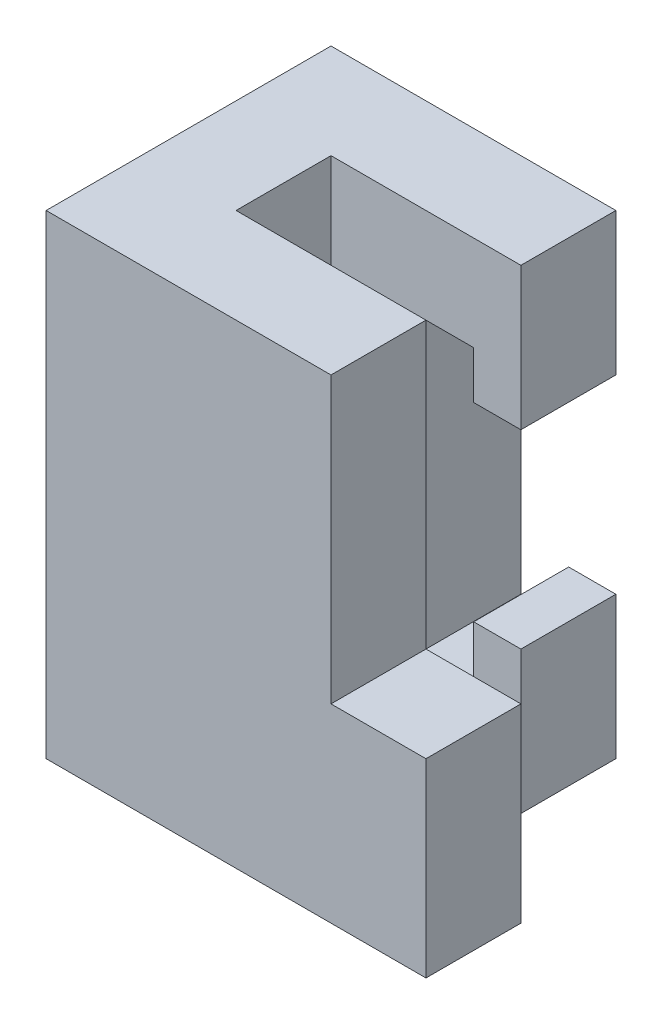
ISO-10303-21;
HEADER;
FILE_DESCRIPTION(('STEP AP214'),'2;1');
FILE_NAME('part.step','',(''),(''),'','','');
FILE_SCHEMA(('AUTOMOTIVE_DESIGN { 1 0 10303 214 1 1 1 1 }'));
ENDSEC;
DATA;
#1=APPLICATION_CONTEXT('core data for automotive mechanical design processes');
#2=APPLICATION_PROTOCOL_DEFINITION('international standard','automotive_design',2000,#1);
#3=PRODUCT_CONTEXT('',#1,'mechanical');
#4=PRODUCT('Part','Part','',(#3));
#5=PRODUCT_RELATED_PRODUCT_CATEGORY('part','',(#4));
#6=PRODUCT_DEFINITION_FORMATION('','',#4);
#7=PRODUCT_DEFINITION_CONTEXT('part definition',#1,'design');
#8=PRODUCT_DEFINITION('design','',#6,#7);
#9=PRODUCT_DEFINITION_SHAPE('','',#8);
#10=(LENGTH_UNIT() NAMED_UNIT(*) SI_UNIT(.MILLI.,.METRE.));
#11=(NAMED_UNIT(*) PLANE_ANGLE_UNIT() SI_UNIT($,.RADIAN.));
#12=(NAMED_UNIT(*) SI_UNIT($,.STERADIAN.) SOLID_ANGLE_UNIT());
#13=UNCERTAINTY_MEASURE_WITH_UNIT(LENGTH_MEASURE(1.E-05),#10,'distance_accuracy_value','');
#14=(GEOMETRIC_REPRESENTATION_CONTEXT(3) GLOBAL_UNCERTAINTY_ASSIGNED_CONTEXT((#13)) GLOBAL_UNIT_ASSIGNED_CONTEXT((#10,
#11,#12)) REPRESENTATION_CONTEXT('',''));
#15=CARTESIAN_POINT('',(0.,0.,0.));
#16=DIRECTION('',(0.,0.,1.));
#17=DIRECTION('',(1.,0.,0.));
#18=AXIS2_PLACEMENT_3D('',#15,#16,#17);
#19=CARTESIAN_POINT('',(25.4,63.5,0.));
#20=DIRECTION('',(-1.,0.,0.));
#21=DIRECTION('',(0.,0.,1.));
#22=AXIS2_PLACEMENT_3D('',#19,#20,#21);
#23=PLANE('',#22);
#24=DIRECTION('',(0.,0.,1.));
#25=VECTOR('',#24,1.);
#26=CARTESIAN_POINT('',(25.4,25.4,0.));
#27=LINE('',#26,#25);
#28=CARTESIAN_POINT('',(25.4,25.4,0.));
#29=VERTEX_POINT('',#28);
#30=CARTESIAN_POINT('',(25.4,25.4,12.7));
#31=VERTEX_POINT('',#30);
#32=EDGE_CURVE('E59',#29,#31,#27,.T.);
#33=ORIENTED_EDGE('',*,*,#32,.F.);
#34=DIRECTION('',(0.,-1.,0.));
#35=VECTOR('',#34,1.);
#36=CARTESIAN_POINT('',(25.4,63.5,0.));
#37=LINE('',#36,#35);
#38=CARTESIAN_POINT('',(25.4,63.5,0.));
#39=VERTEX_POINT('',#38);
#40=EDGE_CURVE('E334',#39,#29,#37,.T.);
#41=ORIENTED_EDGE('',*,*,#40,.F.);
#42=DIRECTION('',(0.,0.,-1.));
#43=VECTOR('',#42,1.);
#44=CARTESIAN_POINT('',(25.4,63.5,0.));
#45=LINE('',#44,#43);
#46=CARTESIAN_POINT('',(25.4,63.5,12.7));
#47=VERTEX_POINT('',#46);
#48=EDGE_CURVE('E307',#47,#39,#45,.T.);
#49=ORIENTED_EDGE('',*,*,#48,.F.);
#50=DIRECTION('',(0.,-1.,0.));
#51=VECTOR('',#50,1.);
#52=CARTESIAN_POINT('',(25.4,63.5,12.7));
#53=LINE('',#52,#51);
#54=EDGE_CURVE('E55',#47,#31,#53,.T.);
#55=ORIENTED_EDGE('',*,*,#54,.T.);
#56=EDGE_LOOP('',(#33,#41,#49,#55));
#57=FACE_BOUND('',#56,.T.);
#58=ADVANCED_FACE('F39',(#57),#23,.F.);
#59=CARTESIAN_POINT('',(25.4,63.5,-25.4));
#60=DIRECTION('',(-1.,0.,0.));
#61=DIRECTION('',(0.,0.,1.));
#62=AXIS2_PLACEMENT_3D('',#59,#60,#61);
#63=PLANE('',#62);
#64=DIRECTION('',(0.,-1.,0.));
#65=VECTOR('',#64,1.);
#66=CARTESIAN_POINT('',(25.4,63.5,-12.7));
#67=LINE('',#66,#65);
#68=CARTESIAN_POINT('',(25.4,63.5,-12.7));
#69=VERTEX_POINT('',#68);
#70=CARTESIAN_POINT('',(25.4,44.45,-12.7));
#71=VERTEX_POINT('',#70);
#72=EDGE_CURVE('E48',#69,#71,#67,.T.);
#73=ORIENTED_EDGE('',*,*,#72,.T.);
#74=DIRECTION('',(0.,0.,-1.));
#75=VECTOR('',#74,1.);
#76=CARTESIAN_POINT('',(25.4,44.45,-12.7));
#77=LINE('',#76,#75);
#78=CARTESIAN_POINT('',(25.4,44.45,-25.4));
#79=VERTEX_POINT('',#78);
#80=EDGE_CURVE('E265',#71,#79,#77,.T.);
#81=ORIENTED_EDGE('',*,*,#80,.T.);
#82=DIRECTION('',(0.,-1.,0.));
#83=VECTOR('',#82,1.);
#84=CARTESIAN_POINT('',(25.4,63.5,-25.4));
#85=LINE('',#84,#83);
#86=CARTESIAN_POINT('',(25.4,63.5,-25.4));
#87=VERTEX_POINT('',#86);
#88=EDGE_CURVE('E348',#87,#79,#85,.T.);
#89=ORIENTED_EDGE('',*,*,#88,.F.);
#90=DIRECTION('',(0.,0.,-1.));
#91=VECTOR('',#90,1.);
#92=CARTESIAN_POINT('',(25.4,63.5,-25.4));
#93=LINE('',#92,#91);
#94=EDGE_CURVE('E295',#69,#87,#93,.T.);
#95=ORIENTED_EDGE('',*,*,#94,.F.);
#96=EDGE_LOOP('',(#73,#81,#89,#95));
#97=FACE_BOUND('',#96,.T.);
#98=ADVANCED_FACE('F384',(#97),#63,.F.);
#99=CARTESIAN_POINT('',(0.,63.5,-12.7));
#100=DIRECTION('',(-1.,0.,0.));
#101=DIRECTION('',(0.,0.,1.));
#102=AXIS2_PLACEMENT_3D('',#99,#100,#101);
#103=PLANE('',#102);
#104=DIRECTION('',(0.,0.,-1.));
#105=VECTOR('',#104,1.);
#106=CARTESIAN_POINT('',(0.,0.,-12.7));
#107=LINE('',#106,#105);
#108=CARTESIAN_POINT('',(0.,0.,0.));
#109=VERTEX_POINT('',#108);
#110=CARTESIAN_POINT('',(0.,0.,-12.7));
#111=VERTEX_POINT('',#110);
#112=EDGE_CURVE('E172',#109,#111,#107,.T.);
#113=ORIENTED_EDGE('',*,*,#112,.T.);
#114=DIRECTION('',(0.,-1.,0.));
#115=VECTOR('',#114,1.);
#116=CARTESIAN_POINT('',(0.,63.5,-12.7));
#117=LINE('',#116,#115);
#118=CARTESIAN_POINT('',(0.,63.5,-12.7));
#119=VERTEX_POINT('',#118);
#120=EDGE_CURVE('E11',#119,#111,#117,.T.);
#121=ORIENTED_EDGE('',*,*,#120,.F.);
#122=DIRECTION('',(0.,0.,-1.));
#123=VECTOR('',#122,1.);
#124=CARTESIAN_POINT('',(0.,63.5,-12.7));
#125=LINE('',#124,#123);
#126=CARTESIAN_POINT('',(0.,63.5,0.));
#127=VERTEX_POINT('',#126);
#128=EDGE_CURVE('E177',#127,#119,#125,.T.);
#129=ORIENTED_EDGE('',*,*,#128,.F.);
#130=DIRECTION('',(0.,-1.,0.));
#131=VECTOR('',#130,1.);
#132=CARTESIAN_POINT('',(0.,63.5,0.));
#133=LINE('',#132,#131);
#134=EDGE_CURVE('E313',#127,#109,#133,.T.);
#135=ORIENTED_EDGE('',*,*,#134,.T.);
#136=EDGE_LOOP('',(#113,#121,#129,#135));
#137=FACE_BOUND('',#136,.T.);
#138=ADVANCED_FACE('F41',(#137),#103,.F.);
#139=CARTESIAN_POINT('',(25.4,63.5,-12.7));
#140=DIRECTION('',(0.,0.,-1.));
#141=DIRECTION('',(-1.,0.,0.));
#142=AXIS2_PLACEMENT_3D('',#139,#140,#141);
#143=PLANE('',#142);
#144=DIRECTION('',(0.,-1.,0.));
#145=VECTOR('',#144,1.);
#146=CARTESIAN_POINT('',(19.05,44.45,-12.7));
#147=LINE('',#146,#145);
#148=CARTESIAN_POINT('',(19.05,50.8,-12.7));
#149=VERTEX_POINT('',#148);
#150=CARTESIAN_POINT('',(19.05,44.45,-12.7));
#151=VERTEX_POINT('',#150);
#152=EDGE_CURVE('E231',#149,#151,#147,.T.);
#153=ORIENTED_EDGE('',*,*,#152,.T.);
#154=DIRECTION('',(1.,0.,0.));
#155=VECTOR('',#154,1.);
#156=CARTESIAN_POINT('',(25.4,44.45,-12.7));
#157=LINE('',#156,#155);
#158=EDGE_CURVE('E235',#151,#71,#157,.T.);
#159=ORIENTED_EDGE('',*,*,#158,.T.);
#160=ORIENTED_EDGE('',*,*,#72,.F.);
#161=DIRECTION('',(1.,0.,0.));
#162=VECTOR('',#161,1.);
#163=CARTESIAN_POINT('',(25.4,63.5,-12.7));
#164=LINE('',#163,#162);
#165=EDGE_CURVE('E292',#119,#69,#164,.T.);
#166=ORIENTED_EDGE('',*,*,#165,.F.);
#167=ORIENTED_EDGE('',*,*,#120,.T.);
#168=DIRECTION('',(1.,0.,0.));
#169=VECTOR('',#168,1.);
#170=CARTESIAN_POINT('',(25.4,0.,-12.7));
#171=LINE('',#170,#169);
#172=CARTESIAN_POINT('',(25.4,0.,-12.7));
#173=VERTEX_POINT('',#172);
#174=EDGE_CURVE('E316',#111,#173,#171,.T.);
#175=ORIENTED_EDGE('',*,*,#174,.T.);
#176=CARTESIAN_POINT('',(25.4,19.05,-12.7));
#177=VERTEX_POINT('',#176);
#178=EDGE_CURVE('E351',#177,#173,#67,.T.);
#179=ORIENTED_EDGE('',*,*,#178,.F.);
#180=DIRECTION('',(-1.,0.,0.));
#181=VECTOR('',#180,1.);
#182=CARTESIAN_POINT('',(19.0886681488394,19.05,-12.7));
#183=LINE('',#182,#181);
#184=CARTESIAN_POINT('',(19.0886681488394,19.05,-12.7));
#185=VERTEX_POINT('',#184);
#186=EDGE_CURVE('E210',#177,#185,#183,.T.);
#187=ORIENTED_EDGE('',*,*,#186,.T.);
#188=DIRECTION('',(0.,-1.,0.));
#189=VECTOR('',#188,1.);
#190=CARTESIAN_POINT('',(19.0886681488394,12.7,-12.7));
#191=LINE('',#190,#189);
#192=CARTESIAN_POINT('',(19.0886681488394,12.7,-12.7));
#193=VERTEX_POINT('',#192);
#194=EDGE_CURVE('E214',#185,#193,#191,.T.);
#195=ORIENTED_EDGE('',*,*,#194,.T.);
#196=DIRECTION('',(-1.,0.,0.));
#197=VECTOR('',#196,1.);
#198=CARTESIAN_POINT('',(12.7,12.7,-12.7));
#199=LINE('',#198,#197);
#200=CARTESIAN_POINT('',(12.7,12.7,-12.7));
#201=VERTEX_POINT('',#200);
#202=EDGE_CURVE('E219',#193,#201,#199,.T.);
#203=ORIENTED_EDGE('',*,*,#202,.T.);
#204=DIRECTION('',(0.,1.,0.));
#205=VECTOR('',#204,1.);
#206=CARTESIAN_POINT('',(12.7,50.8,-12.7));
#207=LINE('',#206,#205);
#208=CARTESIAN_POINT('',(12.7,50.8,-12.7));
#209=VERTEX_POINT('',#208);
#210=EDGE_CURVE('E223',#201,#209,#207,.T.);
#211=ORIENTED_EDGE('',*,*,#210,.T.);
#212=DIRECTION('',(1.,0.,0.));
#213=VECTOR('',#212,1.);
#214=CARTESIAN_POINT('',(19.05,50.8,-12.7));
#215=LINE('',#214,#213);
#216=EDGE_CURVE('E227',#209,#149,#215,.T.);
#217=ORIENTED_EDGE('',*,*,#216,.T.);
#218=EDGE_LOOP('',(#153,#159,#160,#166,#167,#175,#179,#187,#195,#203,#211,#217));
#219=FACE_BOUND('',#218,.T.);
#220=ADVANCED_FACE('F366',(#219),#143,.F.);
#221=CARTESIAN_POINT('',(25.4,19.05,-25.4));
#222=VERTEX_POINT('',#221);
#223=CARTESIAN_POINT('',(25.4,0.,-25.4));
#224=VERTEX_POINT('',#223);
#225=EDGE_CURVE('E347',#222,#224,#85,.T.);
#226=ORIENTED_EDGE('',*,*,#225,.F.);
#227=DIRECTION('',(0.,0.,-1.));
#228=VECTOR('',#227,1.);
#229=CARTESIAN_POINT('',(25.4,19.05,-12.7));
#230=LINE('',#229,#228);
#231=EDGE_CURVE('E239',#177,#222,#230,.T.);
#232=ORIENTED_EDGE('',*,*,#231,.F.);
#233=ORIENTED_EDGE('',*,*,#178,.T.);
#234=DIRECTION('',(0.,0.,-1.));
#235=VECTOR('',#234,1.);
#236=CARTESIAN_POINT('',(25.4,0.,-25.4));
#237=LINE('',#236,#235);
#238=EDGE_CURVE('E320',#173,#224,#237,.T.);
#239=ORIENTED_EDGE('',*,*,#238,.T.);
#240=EDGE_LOOP('',(#226,#232,#233,#239));
#241=FACE_BOUND('',#240,.T.);
#242=ADVANCED_FACE('F362',(#241),#63,.F.);
#243=CARTESIAN_POINT('',(-12.7,63.5,-25.4));
#244=DIRECTION('',(0.,0.,1.));
#245=DIRECTION('',(1.,0.,0.));
#246=AXIS2_PLACEMENT_3D('',#243,#244,#245);
#247=PLANE('',#246);
#248=ORIENTED_EDGE('',*,*,#88,.T.);
#249=DIRECTION('',(1.,0.,0.));
#250=VECTOR('',#249,1.);
#251=CARTESIAN_POINT('',(25.4,44.45,-25.4));
#252=LINE('',#251,#250);
#253=CARTESIAN_POINT('',(19.05,44.45,-25.4));
#254=VERTEX_POINT('',#253);
#255=EDGE_CURVE('E215',#254,#79,#252,.T.);
#256=ORIENTED_EDGE('',*,*,#255,.F.);
#257=DIRECTION('',(0.,-1.,0.));
#258=VECTOR('',#257,1.);
#259=CARTESIAN_POINT('',(19.05,44.45,-25.4));
#260=LINE('',#259,#258);
#261=CARTESIAN_POINT('',(19.05,50.8,-25.4));
#262=VERTEX_POINT('',#261);
#263=EDGE_CURVE('E259',#262,#254,#260,.T.);
#264=ORIENTED_EDGE('',*,*,#263,.F.);
#265=DIRECTION('',(1.,0.,0.));
#266=VECTOR('',#265,1.);
#267=CARTESIAN_POINT('',(19.05,50.8,-25.4));
#268=LINE('',#267,#266);
#269=CARTESIAN_POINT('',(12.7,50.8,-25.4));
#270=VERTEX_POINT('',#269);
#271=EDGE_CURVE('E255',#270,#262,#268,.T.);
#272=ORIENTED_EDGE('',*,*,#271,.F.);
#273=DIRECTION('',(0.,1.,0.));
#274=VECTOR('',#273,1.);
#275=CARTESIAN_POINT('',(12.7,50.8,-25.4));
#276=LINE('',#275,#274);
#277=CARTESIAN_POINT('',(12.7,12.7,-25.4));
#278=VERTEX_POINT('',#277);
#279=EDGE_CURVE('E251',#278,#270,#276,.T.);
#280=ORIENTED_EDGE('',*,*,#279,.F.);
#281=DIRECTION('',(-1.,0.,0.));
#282=VECTOR('',#281,1.);
#283=CARTESIAN_POINT('',(12.7,12.7,-25.4));
#284=LINE('',#283,#282);
#285=CARTESIAN_POINT('',(19.0886681488394,12.7,-25.4));
#286=VERTEX_POINT('',#285);
#287=EDGE_CURVE('E247',#286,#278,#284,.T.);
#288=ORIENTED_EDGE('',*,*,#287,.F.);
#289=DIRECTION('',(0.,-1.,0.));
#290=VECTOR('',#289,1.);
#291=CARTESIAN_POINT('',(19.0886681488394,12.7,-25.4));
#292=LINE('',#291,#290);
#293=CARTESIAN_POINT('',(19.0886681488394,19.05,-25.4));
#294=VERTEX_POINT('',#293);
#295=EDGE_CURVE('E243',#294,#286,#292,.T.);
#296=ORIENTED_EDGE('',*,*,#295,.F.);
#297=DIRECTION('',(-1.,0.,0.));
#298=VECTOR('',#297,1.);
#299=CARTESIAN_POINT('',(19.0886681488394,19.05,-25.4));
#300=LINE('',#299,#298);
#301=EDGE_CURVE('E209',#222,#294,#300,.T.);
#302=ORIENTED_EDGE('',*,*,#301,.F.);
#303=ORIENTED_EDGE('',*,*,#225,.T.);
#304=DIRECTION('',(-1.,0.,0.));
#305=VECTOR('',#304,1.);
#306=CARTESIAN_POINT('',(-12.7,0.,-25.4));
#307=LINE('',#306,#305);
#308=CARTESIAN_POINT('',(-12.7,0.,-25.4));
#309=VERTEX_POINT('',#308);
#310=EDGE_CURVE('E324',#224,#309,#307,.T.);
#311=ORIENTED_EDGE('',*,*,#310,.T.);
#312=DIRECTION('',(0.,-1.,0.));
#313=VECTOR('',#312,1.);
#314=CARTESIAN_POINT('',(-12.7,63.5,-25.4));
#315=LINE('',#314,#313);
#316=CARTESIAN_POINT('',(-12.7,63.5,-25.4));
#317=VERTEX_POINT('',#316);
#318=EDGE_CURVE('E343',#317,#309,#315,.T.);
#319=ORIENTED_EDGE('',*,*,#318,.F.);
#320=DIRECTION('',(-1.,0.,0.));
#321=VECTOR('',#320,1.);
#322=CARTESIAN_POINT('',(-12.7,63.5,-25.4));
#323=LINE('',#322,#321);
#324=EDGE_CURVE('E298',#87,#317,#323,.T.);
#325=ORIENTED_EDGE('',*,*,#324,.F.);
#326=EDGE_LOOP('',(#248,#256,#264,#272,#280,#288,#296,#302,#303,#311,#319,#325));
#327=FACE_BOUND('',#326,.T.);
#328=ADVANCED_FACE('F371',(#327),#247,.F.);
#329=CARTESIAN_POINT('',(-12.7,63.5,12.7));
#330=DIRECTION('',(1.,0.,0.));
#331=DIRECTION('',(0.,0.,-1.));
#332=AXIS2_PLACEMENT_3D('',#329,#330,#331);
#333=PLANE('',#332);
#334=DIRECTION('',(0.,0.,1.));
#335=VECTOR('',#334,1.);
#336=CARTESIAN_POINT('',(-12.7,0.,12.7));
#337=LINE('',#336,#335);
#338=CARTESIAN_POINT('',(-12.7,0.,12.7));
#339=VERTEX_POINT('',#338);
#340=EDGE_CURVE('E327',#309,#339,#337,.T.);
#341=ORIENTED_EDGE('',*,*,#340,.T.);
#342=DIRECTION('',(0.,-1.,0.));
#343=VECTOR('',#342,1.);
#344=CARTESIAN_POINT('',(-12.7,63.5,12.7));
#345=LINE('',#344,#343);
#346=CARTESIAN_POINT('',(-12.7,63.5,12.7));
#347=VERTEX_POINT('',#346);
#348=EDGE_CURVE('E339',#347,#339,#345,.T.);
#349=ORIENTED_EDGE('',*,*,#348,.F.);
#350=DIRECTION('',(0.,0.,1.));
#351=VECTOR('',#350,1.);
#352=CARTESIAN_POINT('',(-12.7,63.5,12.7));
#353=LINE('',#352,#351);
#354=EDGE_CURVE('E301',#317,#347,#353,.T.);
#355=ORIENTED_EDGE('',*,*,#354,.F.);
#356=ORIENTED_EDGE('',*,*,#318,.T.);
#357=EDGE_LOOP('',(#341,#349,#355,#356));
#358=FACE_BOUND('',#357,.T.);
#359=ADVANCED_FACE('F376',(#358),#333,.F.);
#360=CARTESIAN_POINT('',(25.4,63.5,12.7));
#361=DIRECTION('',(0.,0.,-1.));
#362=DIRECTION('',(-1.,0.,0.));
#363=AXIS2_PLACEMENT_3D('',#360,#361,#362);
#364=PLANE('',#363);
#365=DIRECTION('',(1.,0.,0.));
#366=VECTOR('',#365,1.);
#367=CARTESIAN_POINT('',(25.4,0.,12.7));
#368=LINE('',#367,#366);
#369=CARTESIAN_POINT('',(38.1,0.,12.7));
#370=VERTEX_POINT('',#369);
#371=EDGE_CURVE('E178',#339,#370,#368,.T.);
#372=ORIENTED_EDGE('',*,*,#371,.T.);
#373=DIRECTION('',(0.,-1.,0.));
#374=VECTOR('',#373,1.);
#375=CARTESIAN_POINT('',(38.1,25.4,12.7));
#376=LINE('',#375,#374);
#377=CARTESIAN_POINT('',(38.1,25.4,12.7));
#378=VERTEX_POINT('',#377);
#379=EDGE_CURVE('E193',#378,#370,#376,.T.);
#380=ORIENTED_EDGE('',*,*,#379,.F.);
#381=DIRECTION('',(-1.,0.,0.));
#382=VECTOR('',#381,1.);
#383=CARTESIAN_POINT('',(38.1,25.4,12.7));
#384=LINE('',#383,#382);
#385=EDGE_CURVE('E202',#378,#31,#384,.T.);
#386=ORIENTED_EDGE('',*,*,#385,.T.);
#387=ORIENTED_EDGE('',*,*,#54,.F.);
#388=DIRECTION('',(1.,0.,0.));
#389=VECTOR('',#388,1.);
#390=CARTESIAN_POINT('',(25.4,63.5,12.7));
#391=LINE('',#390,#389);
#392=EDGE_CURVE('E304',#347,#47,#391,.T.);
#393=ORIENTED_EDGE('',*,*,#392,.F.);
#394=ORIENTED_EDGE('',*,*,#348,.T.);
#395=EDGE_LOOP('',(#372,#380,#386,#387,#393,#394));
#396=FACE_BOUND('',#395,.T.);
#397=ADVANCED_FACE('F429',(#396),#364,.F.);
#398=CARTESIAN_POINT('',(0.,63.5,0.));
#399=DIRECTION('',(0.,0.,1.));
#400=DIRECTION('',(1.,0.,0.));
#401=AXIS2_PLACEMENT_3D('',#398,#399,#400);
#402=PLANE('',#401);
#403=DIRECTION('',(-1.,0.,0.));
#404=VECTOR('',#403,1.);
#405=CARTESIAN_POINT('',(0.,0.,0.));
#406=LINE('',#405,#404);
#407=CARTESIAN_POINT('',(38.1,0.,0.));
#408=VERTEX_POINT('',#407);
#409=EDGE_CURVE('E165',#408,#109,#406,.T.);
#410=ORIENTED_EDGE('',*,*,#409,.T.);
#411=ORIENTED_EDGE('',*,*,#134,.F.);
#412=DIRECTION('',(-1.,0.,0.));
#413=VECTOR('',#412,1.);
#414=CARTESIAN_POINT('',(0.,63.5,0.));
#415=LINE('',#414,#413);
#416=EDGE_CURVE('E310',#39,#127,#415,.T.);
#417=ORIENTED_EDGE('',*,*,#416,.F.);
#418=ORIENTED_EDGE('',*,*,#40,.T.);
#419=DIRECTION('',(-1.,0.,0.));
#420=VECTOR('',#419,1.);
#421=CARTESIAN_POINT('',(38.1,25.4,0.));
#422=LINE('',#421,#420);
#423=CARTESIAN_POINT('',(38.1,25.4,0.));
#424=VERTEX_POINT('',#423);
#425=EDGE_CURVE('E184',#424,#29,#422,.T.);
#426=ORIENTED_EDGE('',*,*,#425,.F.);
#427=DIRECTION('',(0.,1.,0.));
#428=VECTOR('',#427,1.);
#429=CARTESIAN_POINT('',(38.1,0.,0.));
#430=LINE('',#429,#428);
#431=EDGE_CURVE('E181',#408,#424,#430,.T.);
#432=ORIENTED_EDGE('',*,*,#431,.F.);
#433=EDGE_LOOP('',(#410,#411,#417,#418,#426,#432));
#434=FACE_BOUND('',#433,.T.);
#435=ADVANCED_FACE('F182',(#434),#402,.F.);
#436=CARTESIAN_POINT('',(0.,63.5,0.));
#437=DIRECTION('',(0.,1.,0.));
#438=DIRECTION('',(0.,0.,1.));
#439=AXIS2_PLACEMENT_3D('',#436,#437,#438);
#440=PLANE('',#439);
#441=ORIENTED_EDGE('',*,*,#128,.T.);
#442=ORIENTED_EDGE('',*,*,#165,.T.);
#443=ORIENTED_EDGE('',*,*,#94,.T.);
#444=ORIENTED_EDGE('',*,*,#324,.T.);
#445=ORIENTED_EDGE('',*,*,#354,.T.);
#446=ORIENTED_EDGE('',*,*,#392,.T.);
#447=ORIENTED_EDGE('',*,*,#48,.T.);
#448=ORIENTED_EDGE('',*,*,#416,.T.);
#449=EDGE_LOOP('',(#441,#442,#443,#444,#445,#446,#447,#448));
#450=FACE_BOUND('',#449,.T.);
#451=ADVANCED_FACE('F380',(#450),#440,.T.);
#452=CARTESIAN_POINT('',(0.,0.,0.));
#453=DIRECTION('',(0.,1.,0.));
#454=DIRECTION('',(0.,0.,1.));
#455=AXIS2_PLACEMENT_3D('',#452,#453,#454);
#456=PLANE('',#455);
#457=ORIENTED_EDGE('',*,*,#112,.F.);
#458=ORIENTED_EDGE('',*,*,#409,.F.);
#459=DIRECTION('',(0.,0.,-1.));
#460=VECTOR('',#459,1.);
#461=CARTESIAN_POINT('',(38.1,0.,12.7));
#462=LINE('',#461,#460);
#463=EDGE_CURVE('E170',#370,#408,#462,.T.);
#464=ORIENTED_EDGE('',*,*,#463,.F.);
#465=ORIENTED_EDGE('',*,*,#371,.F.);
#466=ORIENTED_EDGE('',*,*,#340,.F.);
#467=ORIENTED_EDGE('',*,*,#310,.F.);
#468=ORIENTED_EDGE('',*,*,#238,.F.);
#469=ORIENTED_EDGE('',*,*,#174,.F.);
#470=EDGE_LOOP('',(#457,#458,#464,#465,#466,#467,#468,#469));
#471=FACE_BOUND('',#470,.T.);
#472=ADVANCED_FACE('F167',(#471),#456,.F.);
#473=CARTESIAN_POINT('',(25.4,44.45,-12.7));
#474=DIRECTION('',(0.,1.,0.));
#475=DIRECTION('',(0.,0.,1.));
#476=AXIS2_PLACEMENT_3D('',#473,#474,#475);
#477=PLANE('',#476);
#478=ORIENTED_EDGE('',*,*,#255,.T.);
#479=ORIENTED_EDGE('',*,*,#80,.F.);
#480=ORIENTED_EDGE('',*,*,#158,.F.);
#481=DIRECTION('',(0.,0.,-1.));
#482=VECTOR('',#481,1.);
#483=CARTESIAN_POINT('',(19.05,44.45,-12.7));
#484=LINE('',#483,#482);
#485=EDGE_CURVE('E269',#151,#254,#484,.T.);
#486=ORIENTED_EDGE('',*,*,#485,.T.);
#487=EDGE_LOOP('',(#478,#479,#480,#486));
#488=FACE_BOUND('',#487,.T.);
#489=ADVANCED_FACE('F387',(#488),#477,.F.);
#490=CARTESIAN_POINT('',(19.05,44.45,-12.7));
#491=DIRECTION('',(1.,0.,0.));
#492=DIRECTION('',(0.,0.,-1.));
#493=AXIS2_PLACEMENT_3D('',#490,#491,#492);
#494=PLANE('',#493);
#495=ORIENTED_EDGE('',*,*,#263,.T.);
#496=ORIENTED_EDGE('',*,*,#485,.F.);
#497=ORIENTED_EDGE('',*,*,#152,.F.);
#498=DIRECTION('',(0.,0.,-1.));
#499=VECTOR('',#498,1.);
#500=CARTESIAN_POINT('',(19.05,50.8,-12.7));
#501=LINE('',#500,#499);
#502=EDGE_CURVE('E272',#149,#262,#501,.T.);
#503=ORIENTED_EDGE('',*,*,#502,.T.);
#504=EDGE_LOOP('',(#495,#496,#497,#503));
#505=FACE_BOUND('',#504,.T.);
#506=ADVANCED_FACE('F391',(#505),#494,.F.);
#507=CARTESIAN_POINT('',(19.05,50.8,-12.7));
#508=DIRECTION('',(0.,1.,0.));
#509=DIRECTION('',(0.,0.,1.));
#510=AXIS2_PLACEMENT_3D('',#507,#508,#509);
#511=PLANE('',#510);
#512=ORIENTED_EDGE('',*,*,#271,.T.);
#513=ORIENTED_EDGE('',*,*,#502,.F.);
#514=ORIENTED_EDGE('',*,*,#216,.F.);
#515=DIRECTION('',(0.,0.,-1.));
#516=VECTOR('',#515,1.);
#517=CARTESIAN_POINT('',(12.7,50.8,-12.7));
#518=LINE('',#517,#516);
#519=EDGE_CURVE('E275',#209,#270,#518,.T.);
#520=ORIENTED_EDGE('',*,*,#519,.T.);
#521=EDGE_LOOP('',(#512,#513,#514,#520));
#522=FACE_BOUND('',#521,.T.);
#523=ADVANCED_FACE('F396',(#522),#511,.F.);
#524=CARTESIAN_POINT('',(12.7,50.8,-12.7));
#525=DIRECTION('',(-1.,0.,0.));
#526=DIRECTION('',(0.,-1.,0.));
#527=AXIS2_PLACEMENT_3D('',#524,#525,#526);
#528=PLANE('',#527);
#529=ORIENTED_EDGE('',*,*,#279,.T.);
#530=ORIENTED_EDGE('',*,*,#519,.F.);
#531=ORIENTED_EDGE('',*,*,#210,.F.);
#532=DIRECTION('',(0.,0.,-1.));
#533=VECTOR('',#532,1.);
#534=CARTESIAN_POINT('',(12.7,12.7,-12.7));
#535=LINE('',#534,#533);
#536=EDGE_CURVE('E278',#201,#278,#535,.T.);
#537=ORIENTED_EDGE('',*,*,#536,.T.);
#538=EDGE_LOOP('',(#529,#530,#531,#537));
#539=FACE_BOUND('',#538,.T.);
#540=ADVANCED_FACE('F399',(#539),#528,.F.);
#541=CARTESIAN_POINT('',(12.7,12.7,-12.7));
#542=DIRECTION('',(0.,-1.,0.));
#543=DIRECTION('',(1.,0.,0.));
#544=AXIS2_PLACEMENT_3D('',#541,#542,#543);
#545=PLANE('',#544);
#546=ORIENTED_EDGE('',*,*,#287,.T.);
#547=ORIENTED_EDGE('',*,*,#536,.F.);
#548=ORIENTED_EDGE('',*,*,#202,.F.);
#549=DIRECTION('',(0.,0.,-1.));
#550=VECTOR('',#549,1.);
#551=CARTESIAN_POINT('',(19.0886681488394,12.7,-12.7));
#552=LINE('',#551,#550);
#553=EDGE_CURVE('E281',#193,#286,#552,.T.);
#554=ORIENTED_EDGE('',*,*,#553,.T.);
#555=EDGE_LOOP('',(#546,#547,#548,#554));
#556=FACE_BOUND('',#555,.T.);
#557=ADVANCED_FACE('F402',(#556),#545,.F.);
#558=CARTESIAN_POINT('',(19.0886681488394,12.7,-12.7));
#559=DIRECTION('',(1.,0.,0.));
#560=DIRECTION('',(0.,0.,-1.));
#561=AXIS2_PLACEMENT_3D('',#558,#559,#560);
#562=PLANE('',#561);
#563=ORIENTED_EDGE('',*,*,#295,.T.);
#564=ORIENTED_EDGE('',*,*,#553,.F.);
#565=ORIENTED_EDGE('',*,*,#194,.F.);
#566=DIRECTION('',(0.,0.,-1.));
#567=VECTOR('',#566,1.);
#568=CARTESIAN_POINT('',(19.0886681488394,19.05,-12.7));
#569=LINE('',#568,#567);
#570=EDGE_CURVE('E284',#185,#294,#569,.T.);
#571=ORIENTED_EDGE('',*,*,#570,.T.);
#572=EDGE_LOOP('',(#563,#564,#565,#571));
#573=FACE_BOUND('',#572,.T.);
#574=ADVANCED_FACE('F405',(#573),#562,.F.);
#575=CARTESIAN_POINT('',(19.0886681488394,19.05,-12.7));
#576=DIRECTION('',(0.,-1.,0.));
#577=DIRECTION('',(0.,0.,-1.));
#578=AXIS2_PLACEMENT_3D('',#575,#576,#577);
#579=PLANE('',#578);
#580=ORIENTED_EDGE('',*,*,#301,.T.);
#581=ORIENTED_EDGE('',*,*,#570,.F.);
#582=ORIENTED_EDGE('',*,*,#186,.F.);
#583=ORIENTED_EDGE('',*,*,#231,.T.);
#584=EDGE_LOOP('',(#580,#581,#582,#583));
#585=FACE_BOUND('',#584,.T.);
#586=ADVANCED_FACE('F408',(#585),#579,.F.);
#587=CARTESIAN_POINT('',(38.1,25.4,0.));
#588=DIRECTION('',(0.,-1.,0.));
#589=DIRECTION('',(0.,0.,-1.));
#590=AXIS2_PLACEMENT_3D('',#587,#588,#589);
#591=PLANE('',#590);
#592=ORIENTED_EDGE('',*,*,#32,.T.);
#593=ORIENTED_EDGE('',*,*,#385,.F.);
#594=DIRECTION('',(0.,0.,1.));
#595=VECTOR('',#594,1.);
#596=CARTESIAN_POINT('',(38.1,25.4,0.));
#597=LINE('',#596,#595);
#598=EDGE_CURVE('E188',#424,#378,#597,.T.);
#599=ORIENTED_EDGE('',*,*,#598,.F.);
#600=ORIENTED_EDGE('',*,*,#425,.T.);
#601=EDGE_LOOP('',(#592,#593,#599,#600));
#602=FACE_BOUND('',#601,.T.);
#603=ADVANCED_FACE('F410',(#602),#591,.F.);
#604=CARTESIAN_POINT('',(38.1,0.,0.));
#605=DIRECTION('',(1.,0.,0.));
#606=DIRECTION('',(0.,0.,-1.));
#607=AXIS2_PLACEMENT_3D('',#604,#605,#606);
#608=PLANE('',#607);
#609=ORIENTED_EDGE('',*,*,#463,.T.);
#610=ORIENTED_EDGE('',*,*,#431,.T.);
#611=ORIENTED_EDGE('',*,*,#598,.T.);
#612=ORIENTED_EDGE('',*,*,#379,.T.);
#613=EDGE_LOOP('',(#609,#610,#611,#612));
#614=FACE_BOUND('',#613,.T.);
#615=ADVANCED_FACE('F191',(#614),#608,.T.);
#616=CLOSED_SHELL('',(#58,#98,#138,#220,#242,#328,#359,#397,#435,#451,#472,#489,#506,#523,#540,
#557,#574,#586,#603,#615));
#617=MANIFOLD_SOLID_BREP('B2',#616);
#618=ADVANCED_BREP_SHAPE_REPRESENTATION('',(#18,#617),#14);
#619=SHAPE_DEFINITION_REPRESENTATION(#9,#618);
ENDSEC;
END-ISO-10303-21;
